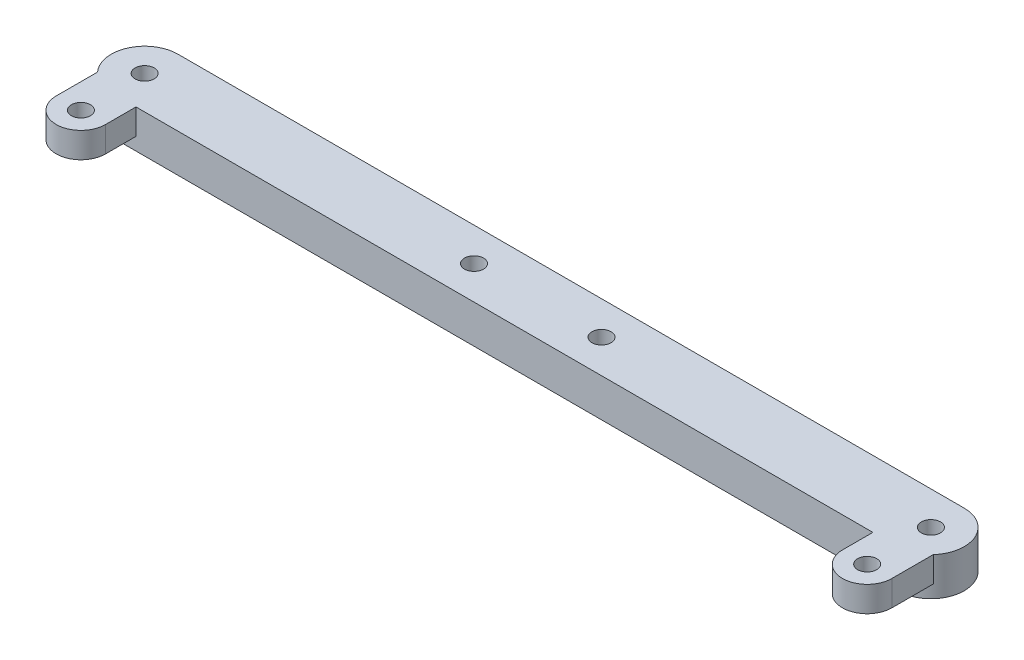
ISO-10303-21;
HEADER;
FILE_DESCRIPTION(('STEP AP214'),'2;1');
FILE_NAME('part.step','',(''),(''),'','','');
FILE_SCHEMA(('AUTOMOTIVE_DESIGN { 1 0 10303 214 1 1 1 1 }'));
ENDSEC;
DATA;
#1=APPLICATION_CONTEXT('core data for automotive mechanical design processes');
#2=APPLICATION_PROTOCOL_DEFINITION('international standard','automotive_design',2000,#1);
#3=PRODUCT_CONTEXT('',#1,'mechanical');
#4=PRODUCT('Part','Part','',(#3));
#5=PRODUCT_RELATED_PRODUCT_CATEGORY('part','',(#4));
#6=PRODUCT_DEFINITION_FORMATION('','',#4);
#7=PRODUCT_DEFINITION_CONTEXT('part definition',#1,'design');
#8=PRODUCT_DEFINITION('design','',#6,#7);
#9=PRODUCT_DEFINITION_SHAPE('','',#8);
#10=(LENGTH_UNIT() NAMED_UNIT(*) SI_UNIT(.MILLI.,.METRE.));
#11=(NAMED_UNIT(*) PLANE_ANGLE_UNIT() SI_UNIT($,.RADIAN.));
#12=(NAMED_UNIT(*) SI_UNIT($,.STERADIAN.) SOLID_ANGLE_UNIT());
#13=UNCERTAINTY_MEASURE_WITH_UNIT(LENGTH_MEASURE(1.E-05),#10,'distance_accuracy_value','');
#14=(GEOMETRIC_REPRESENTATION_CONTEXT(3) GLOBAL_UNCERTAINTY_ASSIGNED_CONTEXT((#13)) GLOBAL_UNIT_ASSIGNED_CONTEXT((#10,
#11,#12)) REPRESENTATION_CONTEXT('',''));
#15=CARTESIAN_POINT('',(0.,0.,0.));
#16=DIRECTION('',(0.,0.,1.));
#17=DIRECTION('',(1.,0.,0.));
#18=AXIS2_PLACEMENT_3D('',#15,#16,#17);
#19=CARTESIAN_POINT('',(0.,6.,0.));
#20=DIRECTION('',(0.,-1.,0.));
#21=DIRECTION('',(0.,0.,-1.));
#22=AXIS2_PLACEMENT_3D('',#19,#20,#21);
#23=CYLINDRICAL_SURFACE('',#22,5.2305560070573);
#24=CARTESIAN_POINT('',(0.,2.,0.));
#25=DIRECTION('',(0.,1.,0.));
#26=DIRECTION('',(0.,0.,1.));
#27=AXIS2_PLACEMENT_3D('',#24,#25,#26);
#28=CIRCLE('',#27,5.2305560070573);
#29=CARTESIAN_POINT('',(-3.87660972403777,2.,3.5114972861244));
#30=VERTEX_POINT('',#29);
#31=CARTESIAN_POINT('',(0.,2.,5.2305560070573));
#32=VERTEX_POINT('',#31);
#33=EDGE_CURVE('E141',#30,#32,#28,.T.);
#34=ORIENTED_EDGE('',*,*,#33,.F.);
#35=DIRECTION('',(0.,-1.,0.));
#36=VECTOR('',#35,1.);
#37=CARTESIAN_POINT('',(-3.87660972403777,6.,3.5114972861244));
#38=LINE('',#37,#36);
#39=CARTESIAN_POINT('',(-3.87660972403777,6.,3.5114972861244));
#40=VERTEX_POINT('',#39);
#41=EDGE_CURVE('E12',#30,#40,#38,.F.);
#42=ORIENTED_EDGE('',*,*,#41,.T.);
#43=CARTESIAN_POINT('',(0.,6.,0.));
#44=DIRECTION('',(0.,1.,0.));
#45=DIRECTION('',(0.,0.,1.));
#46=AXIS2_PLACEMENT_3D('',#43,#44,#45);
#47=CIRCLE('',#46,5.2305560070573);
#48=CARTESIAN_POINT('',(0.,6.,-5.2305560070573));
#49=VERTEX_POINT('',#48);
#50=EDGE_CURVE('E299',#49,#40,#47,.T.);
#51=ORIENTED_EDGE('',*,*,#50,.F.);
#52=DIRECTION('',(0.,-1.,0.));
#53=VECTOR('',#52,1.);
#54=CARTESIAN_POINT('',(0.,6.,-5.2305560070573));
#55=LINE('',#54,#53);
#56=CARTESIAN_POINT('',(0.,0.,-5.2305560070573));
#57=VERTEX_POINT('',#56);
#58=EDGE_CURVE('E309',#49,#57,#55,.T.);
#59=ORIENTED_EDGE('',*,*,#58,.T.);
#60=CARTESIAN_POINT('',(0.,0.,0.));
#61=DIRECTION('',(0.,1.,0.));
#62=DIRECTION('',(0.,0.,1.));
#63=AXIS2_PLACEMENT_3D('',#60,#61,#62);
#64=CIRCLE('',#63,5.2305560070573);
#65=CARTESIAN_POINT('',(0.,0.,5.2305560070573));
#66=VERTEX_POINT('',#65);
#67=EDGE_CURVE('E296',#57,#66,#64,.T.);
#68=ORIENTED_EDGE('',*,*,#67,.T.);
#69=DIRECTION('',(0.,-1.,0.));
#70=VECTOR('',#69,1.);
#71=CARTESIAN_POINT('',(0.,6.,5.2305560070573));
#72=LINE('',#71,#70);
#73=EDGE_CURVE('E325',#32,#66,#72,.T.);
#74=ORIENTED_EDGE('',*,*,#73,.F.);
#75=EDGE_LOOP('',(#34,#42,#51,#59,#68,#74));
#76=FACE_BOUND('',#75,.T.);
#77=ADVANCED_FACE('F126',(#76),#23,.T.);
#78=CARTESIAN_POINT('',(0.,6.,5.2305560070573));
#79=DIRECTION('',(0.,0.,-1.));
#80=DIRECTION('',(-1.,0.,0.));
#81=AXIS2_PLACEMENT_3D('',#78,#79,#80);
#82=PLANE('',#81);
#83=DIRECTION('',(1.,0.,0.));
#84=VECTOR('',#83,1.);
#85=CARTESIAN_POINT('',(0.,2.,5.2305560070573));
#86=LINE('',#85,#84);
#87=CARTESIAN_POINT('',(3.87660972403778,2.,5.2305560070573));
#88=VERTEX_POINT('',#87);
#89=EDGE_CURVE('E250',#32,#88,#86,.T.);
#90=ORIENTED_EDGE('',*,*,#89,.F.);
#91=ORIENTED_EDGE('',*,*,#73,.T.);
#92=DIRECTION('',(1.,0.,0.));
#93=VECTOR('',#92,1.);
#94=CARTESIAN_POINT('',(0.,0.,5.2305560070573));
#95=LINE('',#94,#93);
#96=CARTESIAN_POINT('',(123.36,0.,5.2305560070573));
#97=VERTEX_POINT('',#96);
#98=EDGE_CURVE('E312',#66,#97,#95,.T.);
#99=ORIENTED_EDGE('',*,*,#98,.T.);
#100=DIRECTION('',(0.,-1.,0.));
#101=VECTOR('',#100,1.);
#102=CARTESIAN_POINT('',(123.36,6.,5.2305560070573));
#103=LINE('',#102,#101);
#104=CARTESIAN_POINT('',(123.36,2.,5.2305560070573));
#105=VERTEX_POINT('',#104);
#106=EDGE_CURVE('E323',#105,#97,#103,.T.);
#107=ORIENTED_EDGE('',*,*,#106,.F.);
#108=DIRECTION('',(1.,0.,0.));
#109=VECTOR('',#108,1.);
#110=CARTESIAN_POINT('',(0.,2.,5.2305560070573));
#111=LINE('',#110,#109);
#112=CARTESIAN_POINT('',(119.483390275962,2.,5.2305560070573));
#113=VERTEX_POINT('',#112);
#114=EDGE_CURVE('E284',#113,#105,#111,.T.);
#115=ORIENTED_EDGE('',*,*,#114,.F.);
#116=DIRECTION('',(0.,1.,0.));
#117=VECTOR('',#116,1.);
#118=CARTESIAN_POINT('',(119.483390275962,6.,5.2305560070573));
#119=LINE('',#118,#117);
#120=CARTESIAN_POINT('',(119.483390275962,6.,5.2305560070573));
#121=VERTEX_POINT('',#120);
#122=EDGE_CURVE('E330',#113,#121,#119,.T.);
#123=ORIENTED_EDGE('',*,*,#122,.T.);
#124=DIRECTION('',(1.,0.,0.));
#125=VECTOR('',#124,1.);
#126=CARTESIAN_POINT('',(0.,6.,5.2305560070573));
#127=LINE('',#126,#125);
#128=CARTESIAN_POINT('',(3.87660972403778,6.,5.2305560070573));
#129=VERTEX_POINT('',#128);
#130=EDGE_CURVE('E301',#129,#121,#127,.T.);
#131=ORIENTED_EDGE('',*,*,#130,.F.);
#132=DIRECTION('',(0.,1.,0.));
#133=VECTOR('',#132,1.);
#134=CARTESIAN_POINT('',(3.87660972403778,6.,5.2305560070573));
#135=LINE('',#134,#133);
#136=EDGE_CURVE('E134',#88,#129,#135,.T.);
#137=ORIENTED_EDGE('',*,*,#136,.F.);
#138=EDGE_LOOP('',(#90,#91,#99,#107,#115,#123,#131,#137));
#139=FACE_BOUND('',#138,.T.);
#140=ADVANCED_FACE('F353',(#139),#82,.F.);
#141=CARTESIAN_POINT('',(123.36,6.,0.));
#142=DIRECTION('',(0.,-1.,0.));
#143=DIRECTION('',(0.,0.,-1.));
#144=AXIS2_PLACEMENT_3D('',#141,#142,#143);
#145=CYLINDRICAL_SURFACE('',#144,5.2305560070573);
#146=DIRECTION('',(0.,-1.,0.));
#147=VECTOR('',#146,1.);
#148=CARTESIAN_POINT('',(127.236609724038,6.,3.51149728612441));
#149=LINE('',#148,#147);
#150=CARTESIAN_POINT('',(127.236609724038,2.,3.51149728612441));
#151=VERTEX_POINT('',#150);
#152=CARTESIAN_POINT('',(127.236609724038,6.,3.51149728612441));
#153=VERTEX_POINT('',#152);
#154=EDGE_CURVE('E327',#151,#153,#149,.F.);
#155=ORIENTED_EDGE('',*,*,#154,.F.);
#156=CARTESIAN_POINT('',(123.36,2.,0.));
#157=DIRECTION('',(0.,1.,0.));
#158=DIRECTION('',(0.,0.,1.));
#159=AXIS2_PLACEMENT_3D('',#156,#157,#158);
#160=CIRCLE('',#159,5.2305560070573);
#161=EDGE_CURVE('E280',#105,#151,#160,.T.);
#162=ORIENTED_EDGE('',*,*,#161,.F.);
#163=ORIENTED_EDGE('',*,*,#106,.T.);
#164=CARTESIAN_POINT('',(123.36,0.,0.));
#165=DIRECTION('',(0.,1.,0.));
#166=DIRECTION('',(0.,0.,1.));
#167=AXIS2_PLACEMENT_3D('',#164,#165,#166);
#168=CIRCLE('',#167,5.2305560070573);
#169=CARTESIAN_POINT('',(123.36,0.,-5.2305560070573));
#170=VERTEX_POINT('',#169);
#171=EDGE_CURVE('E315',#97,#170,#168,.T.);
#172=ORIENTED_EDGE('',*,*,#171,.T.);
#173=DIRECTION('',(0.,-1.,0.));
#174=VECTOR('',#173,1.);
#175=CARTESIAN_POINT('',(123.36,6.,-5.2305560070573));
#176=LINE('',#175,#174);
#177=CARTESIAN_POINT('',(123.36,6.,-5.2305560070573));
#178=VERTEX_POINT('',#177);
#179=EDGE_CURVE('E321',#178,#170,#176,.T.);
#180=ORIENTED_EDGE('',*,*,#179,.F.);
#181=CARTESIAN_POINT('',(123.36,6.,0.));
#182=DIRECTION('',(0.,1.,0.));
#183=DIRECTION('',(0.,0.,1.));
#184=AXIS2_PLACEMENT_3D('',#181,#182,#183);
#185=CIRCLE('',#184,5.2305560070573);
#186=EDGE_CURVE('E304',#153,#178,#185,.T.);
#187=ORIENTED_EDGE('',*,*,#186,.F.);
#188=EDGE_LOOP('',(#155,#162,#163,#172,#180,#187));
#189=FACE_BOUND('',#188,.T.);
#190=ADVANCED_FACE('F368',(#189),#145,.T.);
#191=CARTESIAN_POINT('',(0.,6.,0.));
#192=DIRECTION('',(0.,1.,0.));
#193=DIRECTION('',(0.,0.,1.));
#194=AXIS2_PLACEMENT_3D('',#191,#192,#193);
#195=PLANE('',#194);
#196=CARTESIAN_POINT('',(51.68,6.,0.));
#197=DIRECTION('',(0.,1.,0.));
#198=DIRECTION('',(0.,0.,1.));
#199=AXIS2_PLACEMENT_3D('',#196,#197,#198);
#200=CIRCLE('',#199,1.5);
#201=CARTESIAN_POINT('',(51.68,6.,1.50000000000001));
#202=VERTEX_POINT('',#201);
#203=EDGE_CURVE('E335',#202,#202,#200,.T.);
#204=ORIENTED_EDGE('',*,*,#203,.F.);
#205=EDGE_LOOP('',(#204));
#206=FACE_BOUND('',#205,.T.);
#207=CARTESIAN_POINT('',(71.68,6.,0.));
#208=DIRECTION('',(0.,1.,0.));
#209=DIRECTION('',(0.,0.,1.));
#210=AXIS2_PLACEMENT_3D('',#207,#208,#209);
#211=CIRCLE('',#210,1.5);
#212=CARTESIAN_POINT('',(71.68,6.,1.5));
#213=VERTEX_POINT('',#212);
#214=EDGE_CURVE('E340',#213,#213,#211,.T.);
#215=ORIENTED_EDGE('',*,*,#214,.F.);
#216=EDGE_LOOP('',(#215));
#217=FACE_BOUND('',#216,.T.);
#218=DIRECTION('',(0.,0.,1.));
#219=VECTOR('',#218,1.);
#220=CARTESIAN_POINT('',(3.87660972403778,6.,0.));
#221=LINE('',#220,#219);
#222=CARTESIAN_POINT('',(3.87660972403778,6.,10.));
#223=VERTEX_POINT('',#222);
#224=EDGE_CURVE('E215',#129,#223,#221,.T.);
#225=ORIENTED_EDGE('',*,*,#224,.F.);
#226=ORIENTED_EDGE('',*,*,#130,.T.);
#227=DIRECTION('',(0.,0.,1.));
#228=VECTOR('',#227,1.);
#229=CARTESIAN_POINT('',(119.483390275962,6.,0.));
#230=LINE('',#229,#228);
#231=CARTESIAN_POINT('',(119.483390275962,6.,10.));
#232=VERTEX_POINT('',#231);
#233=EDGE_CURVE('E270',#121,#232,#230,.T.);
#234=ORIENTED_EDGE('',*,*,#233,.T.);
#235=CARTESIAN_POINT('',(123.36,6.,10.));
#236=DIRECTION('',(0.,1.,0.));
#237=DIRECTION('',(0.,0.,1.));
#238=AXIS2_PLACEMENT_3D('',#235,#236,#237);
#239=CIRCLE('',#238,3.87660972403777);
#240=CARTESIAN_POINT('',(127.236609724038,6.,10.));
#241=VERTEX_POINT('',#240);
#242=EDGE_CURVE('E272',#241,#232,#239,.F.);
#243=ORIENTED_EDGE('',*,*,#242,.F.);
#244=DIRECTION('',(0.,0.,1.));
#245=VECTOR('',#244,1.);
#246=CARTESIAN_POINT('',(127.236609724038,6.,0.));
#247=LINE('',#246,#245);
#248=EDGE_CURVE('E256',#153,#241,#247,.T.);
#249=ORIENTED_EDGE('',*,*,#248,.F.);
#250=ORIENTED_EDGE('',*,*,#186,.T.);
#251=DIRECTION('',(1.,0.,0.));
#252=VECTOR('',#251,1.);
#253=CARTESIAN_POINT('',(0.,6.,-5.2305560070573));
#254=LINE('',#253,#252);
#255=EDGE_CURVE('E306',#49,#178,#254,.T.);
#256=ORIENTED_EDGE('',*,*,#255,.F.);
#257=ORIENTED_EDGE('',*,*,#50,.T.);
#258=DIRECTION('',(0.,0.,1.));
#259=VECTOR('',#258,1.);
#260=CARTESIAN_POINT('',(-3.87660972403778,6.,0.));
#261=LINE('',#260,#259);
#262=CARTESIAN_POINT('',(-3.87660972403777,6.,10.));
#263=VERTEX_POINT('',#262);
#264=EDGE_CURVE('E237',#40,#263,#261,.T.);
#265=ORIENTED_EDGE('',*,*,#264,.T.);
#266=CARTESIAN_POINT('',(0.,6.,10.));
#267=DIRECTION('',(0.,1.,0.));
#268=DIRECTION('',(0.,0.,1.));
#269=AXIS2_PLACEMENT_3D('',#266,#267,#268);
#270=CIRCLE('',#269,3.87660972403778);
#271=EDGE_CURVE('E223',#263,#223,#270,.T.);
#272=ORIENTED_EDGE('',*,*,#271,.T.);
#273=EDGE_LOOP('',(#225,#226,#234,#243,#249,#250,#256,#257,#265,#272));
#274=FACE_BOUND('',#273,.T.);
#275=CARTESIAN_POINT('',(0.,6.,0.));
#276=DIRECTION('',(0.,1.,0.));
#277=DIRECTION('',(0.,0.,1.));
#278=AXIS2_PLACEMENT_3D('',#275,#276,#277);
#279=CIRCLE('',#278,1.5);
#280=CARTESIAN_POINT('',(0.,6.,1.5));
#281=VERTEX_POINT('',#280);
#282=EDGE_CURVE('E293',#281,#281,#279,.T.);
#283=ORIENTED_EDGE('',*,*,#282,.F.);
#284=EDGE_LOOP('',(#283));
#285=FACE_BOUND('',#284,.T.);
#286=CARTESIAN_POINT('',(0.,6.,10.));
#287=DIRECTION('',(0.,1.,0.));
#288=DIRECTION('',(0.,0.,1.));
#289=AXIS2_PLACEMENT_3D('',#286,#287,#288);
#290=CIRCLE('',#289,1.5);
#291=CARTESIAN_POINT('',(0.,6.,11.5));
#292=VERTEX_POINT('',#291);
#293=EDGE_CURVE('E247',#292,#292,#290,.T.);
#294=ORIENTED_EDGE('',*,*,#293,.F.);
#295=EDGE_LOOP('',(#294));
#296=FACE_BOUND('',#295,.T.);
#297=CARTESIAN_POINT('',(123.36,6.,10.));
#298=DIRECTION('',(0.,1.,0.));
#299=DIRECTION('',(0.,0.,1.));
#300=AXIS2_PLACEMENT_3D('',#297,#298,#299);
#301=CIRCLE('',#300,1.50000000000001);
#302=CARTESIAN_POINT('',(123.36,6.,11.5));
#303=VERTEX_POINT('',#302);
#304=EDGE_CURVE('E260',#303,#303,#301,.F.);
#305=ORIENTED_EDGE('',*,*,#304,.T.);
#306=EDGE_LOOP('',(#305));
#307=FACE_BOUND('',#306,.T.);
#308=CARTESIAN_POINT('',(123.36,6.,0.));
#309=DIRECTION('',(0.,1.,0.));
#310=DIRECTION('',(0.,0.,1.));
#311=AXIS2_PLACEMENT_3D('',#308,#309,#310);
#312=CIRCLE('',#311,1.5);
#313=CARTESIAN_POINT('',(123.36,6.,1.5));
#314=VERTEX_POINT('',#313);
#315=EDGE_CURVE('E287',#314,#314,#312,.T.);
#316=ORIENTED_EDGE('',*,*,#315,.F.);
#317=EDGE_LOOP('',(#316));
#318=FACE_BOUND('',#317,.T.);
#319=ADVANCED_FACE('F234',(#206,#217,#274,#285,#296,#307,#318),#195,.T.);
#320=CARTESIAN_POINT('',(0.,0.,0.));
#321=DIRECTION('',(0.,1.,0.));
#322=DIRECTION('',(0.,0.,1.));
#323=AXIS2_PLACEMENT_3D('',#320,#321,#322);
#324=PLANE('',#323);
#325=CARTESIAN_POINT('',(51.68,0.,0.));
#326=DIRECTION('',(0.,1.,0.));
#327=DIRECTION('',(0.,0.,1.));
#328=AXIS2_PLACEMENT_3D('',#325,#326,#327);
#329=CIRCLE('',#328,1.5);
#330=CARTESIAN_POINT('',(51.68,0.,1.50000000000001));
#331=VERTEX_POINT('',#330);
#332=EDGE_CURVE('E129',#331,#331,#329,.T.);
#333=ORIENTED_EDGE('',*,*,#332,.T.);
#334=EDGE_LOOP('',(#333));
#335=FACE_BOUND('',#334,.T.);
#336=CARTESIAN_POINT('',(71.68,0.,0.));
#337=DIRECTION('',(0.,1.,0.));
#338=DIRECTION('',(0.,0.,1.));
#339=AXIS2_PLACEMENT_3D('',#336,#337,#338);
#340=CIRCLE('',#339,1.5);
#341=CARTESIAN_POINT('',(71.68,0.,1.5));
#342=VERTEX_POINT('',#341);
#343=EDGE_CURVE('E333',#342,#342,#340,.T.);
#344=ORIENTED_EDGE('',*,*,#343,.T.);
#345=EDGE_LOOP('',(#344));
#346=FACE_BOUND('',#345,.T.);
#347=ORIENTED_EDGE('',*,*,#67,.F.);
#348=DIRECTION('',(1.,0.,0.));
#349=VECTOR('',#348,1.);
#350=CARTESIAN_POINT('',(0.,0.,-5.2305560070573));
#351=LINE('',#350,#349);
#352=EDGE_CURVE('E302',#57,#170,#351,.T.);
#353=ORIENTED_EDGE('',*,*,#352,.T.);
#354=ORIENTED_EDGE('',*,*,#171,.F.);
#355=ORIENTED_EDGE('',*,*,#98,.F.);
#356=EDGE_LOOP('',(#347,#353,#354,#355));
#357=FACE_BOUND('',#356,.T.);
#358=CARTESIAN_POINT('',(0.,0.,0.));
#359=DIRECTION('',(0.,1.,0.));
#360=DIRECTION('',(0.,0.,1.));
#361=AXIS2_PLACEMENT_3D('',#358,#359,#360);
#362=CIRCLE('',#361,1.5);
#363=CARTESIAN_POINT('',(0.,0.,1.5));
#364=VERTEX_POINT('',#363);
#365=EDGE_CURVE('E290',#364,#364,#362,.T.);
#366=ORIENTED_EDGE('',*,*,#365,.T.);
#367=EDGE_LOOP('',(#366));
#368=FACE_BOUND('',#367,.T.);
#369=CARTESIAN_POINT('',(123.36,0.,0.));
#370=DIRECTION('',(0.,1.,0.));
#371=DIRECTION('',(0.,0.,1.));
#372=AXIS2_PLACEMENT_3D('',#369,#370,#371);
#373=CIRCLE('',#372,1.5);
#374=CARTESIAN_POINT('',(123.36,0.,1.5));
#375=VERTEX_POINT('',#374);
#376=EDGE_CURVE('E286',#375,#375,#373,.T.);
#377=ORIENTED_EDGE('',*,*,#376,.T.);
#378=EDGE_LOOP('',(#377));
#379=FACE_BOUND('',#378,.T.);
#380=ADVANCED_FACE('F358',(#335,#346,#357,#368,#379),#324,.F.);
#381=CARTESIAN_POINT('',(0.,6.,-5.2305560070573));
#382=DIRECTION('',(0.,0.,-1.));
#383=DIRECTION('',(-1.,0.,0.));
#384=AXIS2_PLACEMENT_3D('',#381,#382,#383);
#385=PLANE('',#384);
#386=ORIENTED_EDGE('',*,*,#352,.F.);
#387=ORIENTED_EDGE('',*,*,#58,.F.);
#388=ORIENTED_EDGE('',*,*,#255,.T.);
#389=ORIENTED_EDGE('',*,*,#179,.T.);
#390=EDGE_LOOP('',(#386,#387,#388,#389));
#391=FACE_BOUND('',#390,.T.);
#392=ADVANCED_FACE('F362',(#391),#385,.T.);
#393=CARTESIAN_POINT('',(0.,6.,0.));
#394=DIRECTION('',(0.,-1.,0.));
#395=DIRECTION('',(0.,0.,-1.));
#396=AXIS2_PLACEMENT_3D('',#393,#394,#395);
#397=CYLINDRICAL_SURFACE('',#396,1.5);
#398=ORIENTED_EDGE('',*,*,#282,.T.);
#399=EDGE_LOOP('',(#398));
#400=FACE_BOUND('',#399,.T.);
#401=ORIENTED_EDGE('',*,*,#365,.F.);
#402=EDGE_LOOP('',(#401));
#403=FACE_BOUND('',#402,.T.);
#404=ADVANCED_FACE('F410',(#400,#403),#397,.F.);
#405=CARTESIAN_POINT('',(123.36,6.,0.));
#406=DIRECTION('',(0.,-1.,0.));
#407=DIRECTION('',(0.,0.,-1.));
#408=AXIS2_PLACEMENT_3D('',#405,#406,#407);
#409=CYLINDRICAL_SURFACE('',#408,1.5);
#410=ORIENTED_EDGE('',*,*,#315,.T.);
#411=EDGE_LOOP('',(#410));
#412=FACE_BOUND('',#411,.T.);
#413=ORIENTED_EDGE('',*,*,#376,.F.);
#414=EDGE_LOOP('',(#413));
#415=FACE_BOUND('',#414,.T.);
#416=ADVANCED_FACE('F395',(#412,#415),#409,.F.);
#417=CARTESIAN_POINT('',(119.483390275962,2.,0.));
#418=DIRECTION('',(-1.,0.,0.));
#419=DIRECTION('',(0.,0.,1.));
#420=AXIS2_PLACEMENT_3D('',#417,#418,#419);
#421=PLANE('',#420);
#422=ORIENTED_EDGE('',*,*,#122,.F.);
#423=DIRECTION('',(0.,0.,1.));
#424=VECTOR('',#423,1.);
#425=CARTESIAN_POINT('',(119.483390275962,2.,0.));
#426=LINE('',#425,#424);
#427=CARTESIAN_POINT('',(119.483390275962,2.,10.));
#428=VERTEX_POINT('',#427);
#429=EDGE_CURVE('E259',#113,#428,#426,.T.);
#430=ORIENTED_EDGE('',*,*,#429,.T.);
#431=DIRECTION('',(0.,1.,0.));
#432=VECTOR('',#431,1.);
#433=CARTESIAN_POINT('',(119.483390275962,2.,10.));
#434=LINE('',#433,#432);
#435=EDGE_CURVE('E268',#428,#232,#434,.T.);
#436=ORIENTED_EDGE('',*,*,#435,.T.);
#437=ORIENTED_EDGE('',*,*,#233,.F.);
#438=EDGE_LOOP('',(#422,#430,#436,#437));
#439=FACE_BOUND('',#438,.T.);
#440=ADVANCED_FACE('F379',(#439),#421,.T.);
#441=CARTESIAN_POINT('',(127.236609724038,2.,0.));
#442=DIRECTION('',(-1.,0.,0.));
#443=DIRECTION('',(0.,0.,1.));
#444=AXIS2_PLACEMENT_3D('',#441,#442,#443);
#445=PLANE('',#444);
#446=DIRECTION('',(0.,0.,1.));
#447=VECTOR('',#446,1.);
#448=CARTESIAN_POINT('',(127.236609724038,2.,0.));
#449=LINE('',#448,#447);
#450=CARTESIAN_POINT('',(127.236609724038,2.,10.));
#451=VERTEX_POINT('',#450);
#452=EDGE_CURVE('E257',#151,#451,#449,.T.);
#453=ORIENTED_EDGE('',*,*,#452,.F.);
#454=ORIENTED_EDGE('',*,*,#154,.T.);
#455=ORIENTED_EDGE('',*,*,#248,.T.);
#456=DIRECTION('',(0.,1.,0.));
#457=VECTOR('',#456,1.);
#458=CARTESIAN_POINT('',(127.236609724038,2.,10.));
#459=LINE('',#458,#457);
#460=EDGE_CURVE('E277',#451,#241,#459,.T.);
#461=ORIENTED_EDGE('',*,*,#460,.F.);
#462=EDGE_LOOP('',(#453,#454,#455,#461));
#463=FACE_BOUND('',#462,.T.);
#464=ADVANCED_FACE('F386',(#463),#445,.F.);
#465=CARTESIAN_POINT('',(0.,2.,0.));
#466=DIRECTION('',(0.,1.,0.));
#467=DIRECTION('',(0.,0.,1.));
#468=AXIS2_PLACEMENT_3D('',#465,#466,#467);
#469=PLANE('',#468);
#470=CARTESIAN_POINT('',(123.36,2.,10.));
#471=DIRECTION('',(0.,1.,0.));
#472=DIRECTION('',(0.,0.,1.));
#473=AXIS2_PLACEMENT_3D('',#470,#471,#472);
#474=CIRCLE('',#473,1.50000000000001);
#475=CARTESIAN_POINT('',(123.36,2.,11.5));
#476=VERTEX_POINT('',#475);
#477=EDGE_CURVE('E265',#476,#476,#474,.F.);
#478=ORIENTED_EDGE('',*,*,#477,.F.);
#479=EDGE_LOOP('',(#478));
#480=FACE_BOUND('',#479,.T.);
#481=ORIENTED_EDGE('',*,*,#429,.F.);
#482=ORIENTED_EDGE('',*,*,#114,.T.);
#483=ORIENTED_EDGE('',*,*,#161,.T.);
#484=ORIENTED_EDGE('',*,*,#452,.T.);
#485=CARTESIAN_POINT('',(123.36,2.,10.));
#486=DIRECTION('',(0.,1.,0.));
#487=DIRECTION('',(0.,0.,1.));
#488=AXIS2_PLACEMENT_3D('',#485,#486,#487);
#489=CIRCLE('',#488,3.87660972403777);
#490=EDGE_CURVE('E262',#451,#428,#489,.F.);
#491=ORIENTED_EDGE('',*,*,#490,.T.);
#492=EDGE_LOOP('',(#481,#482,#483,#484,#491));
#493=FACE_BOUND('',#492,.T.);
#494=ADVANCED_FACE('F374',(#480,#493),#469,.F.);
#495=CARTESIAN_POINT('',(123.36,2.,10.));
#496=DIRECTION('',(0.,1.,0.));
#497=DIRECTION('',(0.,0.,1.));
#498=AXIS2_PLACEMENT_3D('',#495,#496,#497);
#499=CYLINDRICAL_SURFACE('',#498,3.87660972403777);
#500=ORIENTED_EDGE('',*,*,#242,.T.);
#501=ORIENTED_EDGE('',*,*,#435,.F.);
#502=ORIENTED_EDGE('',*,*,#490,.F.);
#503=ORIENTED_EDGE('',*,*,#460,.T.);
#504=EDGE_LOOP('',(#500,#501,#502,#503));
#505=FACE_BOUND('',#504,.T.);
#506=ADVANCED_FACE('F384',(#505),#499,.T.);
#507=CARTESIAN_POINT('',(123.36,2.,10.));
#508=DIRECTION('',(0.,1.,0.));
#509=DIRECTION('',(0.,0.,1.));
#510=AXIS2_PLACEMENT_3D('',#507,#508,#509);
#511=CYLINDRICAL_SURFACE('',#510,1.50000000000001);
#512=ORIENTED_EDGE('',*,*,#477,.T.);
#513=EDGE_LOOP('',(#512));
#514=FACE_BOUND('',#513,.T.);
#515=ORIENTED_EDGE('',*,*,#304,.F.);
#516=EDGE_LOOP('',(#515));
#517=FACE_BOUND('',#516,.T.);
#518=ADVANCED_FACE('F459',(#514,#517),#511,.F.);
#519=CARTESIAN_POINT('',(-3.87660972403778,2.,0.));
#520=DIRECTION('',(-1.,0.,0.));
#521=DIRECTION('',(0.,0.,1.));
#522=AXIS2_PLACEMENT_3D('',#519,#520,#521);
#523=PLANE('',#522);
#524=ORIENTED_EDGE('',*,*,#41,.F.);
#525=DIRECTION('',(0.,0.,1.));
#526=VECTOR('',#525,1.);
#527=CARTESIAN_POINT('',(-3.87660972403778,2.,0.));
#528=LINE('',#527,#526);
#529=CARTESIAN_POINT('',(-3.87660972403777,2.,10.));
#530=VERTEX_POINT('',#529);
#531=EDGE_CURVE('E224',#30,#530,#528,.T.);
#532=ORIENTED_EDGE('',*,*,#531,.T.);
#533=DIRECTION('',(0.,1.,0.));
#534=VECTOR('',#533,1.);
#535=CARTESIAN_POINT('',(-3.87660972403777,2.,10.));
#536=LINE('',#535,#534);
#537=EDGE_CURVE('E232',#530,#263,#536,.T.);
#538=ORIENTED_EDGE('',*,*,#537,.T.);
#539=ORIENTED_EDGE('',*,*,#264,.F.);
#540=EDGE_LOOP('',(#524,#532,#538,#539));
#541=FACE_BOUND('',#540,.T.);
#542=ADVANCED_FACE('F348',(#541),#523,.T.);
#543=CARTESIAN_POINT('',(3.87660972403778,2.,0.));
#544=DIRECTION('',(-1.,0.,0.));
#545=DIRECTION('',(0.,0.,1.));
#546=AXIS2_PLACEMENT_3D('',#543,#544,#545);
#547=PLANE('',#546);
#548=DIRECTION('',(0.,0.,1.));
#549=VECTOR('',#548,1.);
#550=CARTESIAN_POINT('',(3.87660972403778,2.,0.));
#551=LINE('',#550,#549);
#552=CARTESIAN_POINT('',(3.87660972403778,2.,10.));
#553=VERTEX_POINT('',#552);
#554=EDGE_CURVE('E243',#88,#553,#551,.T.);
#555=ORIENTED_EDGE('',*,*,#554,.F.);
#556=ORIENTED_EDGE('',*,*,#136,.T.);
#557=ORIENTED_EDGE('',*,*,#224,.T.);
#558=DIRECTION('',(0.,1.,0.));
#559=VECTOR('',#558,1.);
#560=CARTESIAN_POINT('',(3.87660972403778,2.,10.));
#561=LINE('',#560,#559);
#562=EDGE_CURVE('E219',#553,#223,#561,.T.);
#563=ORIENTED_EDGE('',*,*,#562,.F.);
#564=EDGE_LOOP('',(#555,#556,#557,#563));
#565=FACE_BOUND('',#564,.T.);
#566=ADVANCED_FACE('F218',(#565),#547,.F.);
#567=CARTESIAN_POINT('',(0.,2.,0.));
#568=DIRECTION('',(0.,1.,0.));
#569=DIRECTION('',(0.,0.,1.));
#570=AXIS2_PLACEMENT_3D('',#567,#568,#569);
#571=PLANE('',#570);
#572=CARTESIAN_POINT('',(0.,2.,10.));
#573=DIRECTION('',(0.,1.,0.));
#574=DIRECTION('',(0.,0.,1.));
#575=AXIS2_PLACEMENT_3D('',#572,#573,#574);
#576=CIRCLE('',#575,1.5);
#577=CARTESIAN_POINT('',(0.,2.,11.5));
#578=VERTEX_POINT('',#577);
#579=EDGE_CURVE('E240',#578,#578,#576,.T.);
#580=ORIENTED_EDGE('',*,*,#579,.T.);
#581=EDGE_LOOP('',(#580));
#582=FACE_BOUND('',#581,.T.);
#583=ORIENTED_EDGE('',*,*,#531,.F.);
#584=ORIENTED_EDGE('',*,*,#33,.T.);
#585=ORIENTED_EDGE('',*,*,#89,.T.);
#586=ORIENTED_EDGE('',*,*,#554,.T.);
#587=CARTESIAN_POINT('',(0.,2.,10.));
#588=DIRECTION('',(0.,1.,0.));
#589=DIRECTION('',(0.,0.,1.));
#590=AXIS2_PLACEMENT_3D('',#587,#588,#589);
#591=CIRCLE('',#590,3.87660972403778);
#592=EDGE_CURVE('E231',#530,#553,#591,.T.);
#593=ORIENTED_EDGE('',*,*,#592,.F.);
#594=EDGE_LOOP('',(#583,#584,#585,#586,#593));
#595=FACE_BOUND('',#594,.T.);
#596=ADVANCED_FACE('F351',(#582,#595),#571,.F.);
#597=CARTESIAN_POINT('',(0.,2.,10.));
#598=DIRECTION('',(0.,1.,0.));
#599=DIRECTION('',(0.,0.,1.));
#600=AXIS2_PLACEMENT_3D('',#597,#598,#599);
#601=CYLINDRICAL_SURFACE('',#600,3.87660972403778);
#602=ORIENTED_EDGE('',*,*,#271,.F.);
#603=ORIENTED_EDGE('',*,*,#537,.F.);
#604=ORIENTED_EDGE('',*,*,#592,.T.);
#605=ORIENTED_EDGE('',*,*,#562,.T.);
#606=EDGE_LOOP('',(#602,#603,#604,#605));
#607=FACE_BOUND('',#606,.T.);
#608=ADVANCED_FACE('F228',(#607),#601,.T.);
#609=CARTESIAN_POINT('',(0.,2.,10.));
#610=DIRECTION('',(0.,1.,0.));
#611=DIRECTION('',(0.,0.,1.));
#612=AXIS2_PLACEMENT_3D('',#609,#610,#611);
#613=CYLINDRICAL_SURFACE('',#612,1.5);
#614=ORIENTED_EDGE('',*,*,#579,.F.);
#615=EDGE_LOOP('',(#614));
#616=FACE_BOUND('',#615,.T.);
#617=ORIENTED_EDGE('',*,*,#293,.T.);
#618=EDGE_LOOP('',(#617));
#619=FACE_BOUND('',#618,.T.);
#620=ADVANCED_FACE('F507',(#616,#619),#613,.F.);
#621=CARTESIAN_POINT('',(71.68,-4.,0.));
#622=DIRECTION('',(0.,1.,0.));
#623=DIRECTION('',(0.,0.,1.));
#624=AXIS2_PLACEMENT_3D('',#621,#622,#623);
#625=CYLINDRICAL_SURFACE('',#624,1.5);
#626=ORIENTED_EDGE('',*,*,#214,.T.);
#627=EDGE_LOOP('',(#626));
#628=FACE_BOUND('',#627,.T.);
#629=ORIENTED_EDGE('',*,*,#343,.F.);
#630=EDGE_LOOP('',(#629));
#631=FACE_BOUND('',#630,.T.);
#632=ADVANCED_FACE('F516',(#628,#631),#625,.F.);
#633=CARTESIAN_POINT('',(51.68,-4.,0.));
#634=DIRECTION('',(0.,1.,0.));
#635=DIRECTION('',(0.,0.,1.));
#636=AXIS2_PLACEMENT_3D('',#633,#634,#635);
#637=CYLINDRICAL_SURFACE('',#636,1.5);
#638=ORIENTED_EDGE('',*,*,#203,.T.);
#639=EDGE_LOOP('',(#638));
#640=FACE_BOUND('',#639,.T.);
#641=ORIENTED_EDGE('',*,*,#332,.F.);
#642=EDGE_LOOP('',(#641));
#643=FACE_BOUND('',#642,.T.);
#644=ADVANCED_FACE('F535',(#640,#643),#637,.F.);
#645=CLOSED_SHELL('',(#77,#140,#190,#319,#380,#392,#404,#416,#440,#464,#494,#506,#518,#542,#566,
#596,#608,#620,#632,#644));
#646=MANIFOLD_SOLID_BREP('B2',#645);
#647=ADVANCED_BREP_SHAPE_REPRESENTATION('',(#18,#646),#14);
#648=SHAPE_DEFINITION_REPRESENTATION(#9,#647);
ENDSEC;
END-ISO-10303-21;
